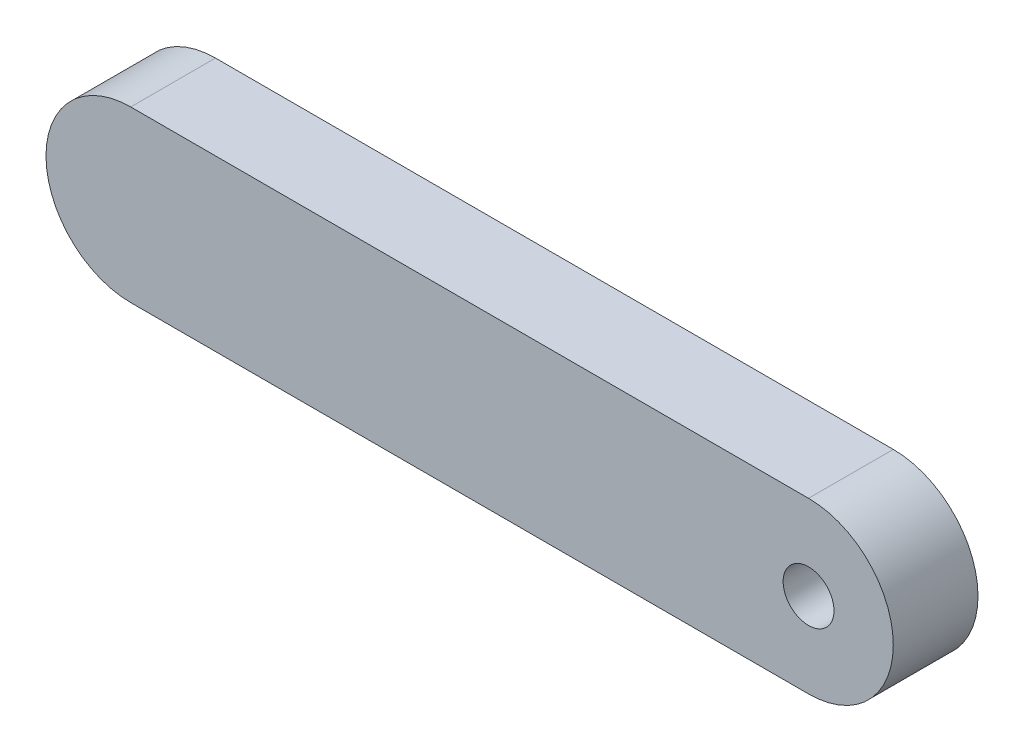
ISO-10303-21;
HEADER;
FILE_DESCRIPTION(('STEP AP214'),'2;1');
FILE_NAME('part.step','',(''),(''),'','','');
FILE_SCHEMA(('AUTOMOTIVE_DESIGN { 1 0 10303 214 1 1 1 1 }'));
ENDSEC;
DATA;
#1=APPLICATION_CONTEXT('core data for automotive mechanical design processes');
#2=APPLICATION_PROTOCOL_DEFINITION('international standard','automotive_design',2000,#1);
#3=PRODUCT_CONTEXT('',#1,'mechanical');
#4=PRODUCT('Part','Part','',(#3));
#5=PRODUCT_RELATED_PRODUCT_CATEGORY('part','',(#4));
#6=PRODUCT_DEFINITION_FORMATION('','',#4);
#7=PRODUCT_DEFINITION_CONTEXT('part definition',#1,'design');
#8=PRODUCT_DEFINITION('design','',#6,#7);
#9=PRODUCT_DEFINITION_SHAPE('','',#8);
#10=(LENGTH_UNIT() NAMED_UNIT(*) SI_UNIT(.MILLI.,.METRE.));
#11=(NAMED_UNIT(*) PLANE_ANGLE_UNIT() SI_UNIT($,.RADIAN.));
#12=(NAMED_UNIT(*) SI_UNIT($,.STERADIAN.) SOLID_ANGLE_UNIT());
#13=UNCERTAINTY_MEASURE_WITH_UNIT(LENGTH_MEASURE(1.E-05),#10,'distance_accuracy_value','');
#14=(GEOMETRIC_REPRESENTATION_CONTEXT(3) GLOBAL_UNCERTAINTY_ASSIGNED_CONTEXT((#13)) GLOBAL_UNIT_ASSIGNED_CONTEXT((#10,
#11,#12)) REPRESENTATION_CONTEXT('',''));
#15=CARTESIAN_POINT('',(0.,0.,0.));
#16=DIRECTION('',(0.,0.,1.));
#17=DIRECTION('',(1.,0.,0.));
#18=AXIS2_PLACEMENT_3D('',#15,#16,#17);
#19=CARTESIAN_POINT('',(-20.,0.,5.));
#20=DIRECTION('',(0.,0.,1.));
#21=DIRECTION('',(1.,0.,0.));
#22=AXIS2_PLACEMENT_3D('',#19,#20,#21);
#23=PLANE('',#22);
#24=CARTESIAN_POINT('',(-20.,0.,5.));
#25=DIRECTION('',(0.,0.,1.));
#26=DIRECTION('',(1.,0.,0.));
#27=AXIS2_PLACEMENT_3D('',#24,#25,#26);
#28=CIRCLE('',#27,5.00000000000001);
#29=CARTESIAN_POINT('',(-20.,5.00000000000001,5.));
#30=VERTEX_POINT('',#29);
#31=CARTESIAN_POINT('',(-20.,-5.00000000000001,5.));
#32=VERTEX_POINT('',#31);
#33=EDGE_CURVE('E85',#30,#32,#28,.T.);
#34=ORIENTED_EDGE('',*,*,#33,.T.);
#35=DIRECTION('',(1.,0.,0.));
#36=VECTOR('',#35,1.);
#37=CARTESIAN_POINT('',(-20.,-5.00000000000001,5.));
#38=LINE('',#37,#36);
#39=CARTESIAN_POINT('',(20.,-5.,5.));
#40=VERTEX_POINT('',#39);
#41=EDGE_CURVE('E80',#32,#40,#38,.T.);
#42=ORIENTED_EDGE('',*,*,#41,.T.);
#43=CARTESIAN_POINT('',(20.,0.,5.));
#44=DIRECTION('',(0.,0.,1.));
#45=DIRECTION('',(1.,0.,0.));
#46=AXIS2_PLACEMENT_3D('',#43,#44,#45);
#47=CIRCLE('',#46,5.00000000000001);
#48=CARTESIAN_POINT('',(20.,5.00000000000001,5.));
#49=VERTEX_POINT('',#48);
#50=EDGE_CURVE('E83',#40,#49,#47,.T.);
#51=ORIENTED_EDGE('',*,*,#50,.T.);
#52=DIRECTION('',(-1.,0.,0.));
#53=VECTOR('',#52,1.);
#54=CARTESIAN_POINT('',(-20.,5.00000000000001,5.));
#55=LINE('',#54,#53);
#56=EDGE_CURVE('E50',#49,#30,#55,.T.);
#57=ORIENTED_EDGE('',*,*,#56,.T.);
#58=EDGE_LOOP('',(#34,#42,#51,#57));
#59=FACE_BOUND('',#58,.T.);
#60=CARTESIAN_POINT('',(20.,0.,5.));
#61=DIRECTION('',(0.,0.,1.));
#62=DIRECTION('',(1.,0.,0.));
#63=AXIS2_PLACEMENT_3D('',#60,#61,#62);
#64=CIRCLE('',#63,1.5);
#65=CARTESIAN_POINT('',(21.5,0.,5.));
#66=VERTEX_POINT('',#65);
#67=EDGE_CURVE('E100',#66,#66,#64,.T.);
#68=ORIENTED_EDGE('',*,*,#67,.F.);
#69=EDGE_LOOP('',(#68));
#70=FACE_BOUND('',#69,.T.);
#71=ADVANCED_FACE('F33',(#59,#70),#23,.T.);
#72=CARTESIAN_POINT('',(-20.,0.,0.));
#73=DIRECTION('',(0.,0.,1.));
#74=DIRECTION('',(1.,0.,0.));
#75=AXIS2_PLACEMENT_3D('',#72,#73,#74);
#76=PLANE('',#75);
#77=CARTESIAN_POINT('',(-20.,0.,0.));
#78=DIRECTION('',(0.,0.,1.));
#79=DIRECTION('',(1.,0.,0.));
#80=AXIS2_PLACEMENT_3D('',#77,#78,#79);
#81=CIRCLE('',#80,5.00000000000001);
#82=CARTESIAN_POINT('',(-20.,5.00000000000001,0.));
#83=VERTEX_POINT('',#82);
#84=CARTESIAN_POINT('',(-20.,-5.00000000000001,0.));
#85=VERTEX_POINT('',#84);
#86=EDGE_CURVE('E97',#83,#85,#81,.T.);
#87=ORIENTED_EDGE('',*,*,#86,.F.);
#88=DIRECTION('',(-1.,0.,0.));
#89=VECTOR('',#88,1.);
#90=CARTESIAN_POINT('',(-20.,5.00000000000001,0.));
#91=LINE('',#90,#89);
#92=CARTESIAN_POINT('',(20.,5.00000000000001,0.));
#93=VERTEX_POINT('',#92);
#94=EDGE_CURVE('E73',#93,#83,#91,.T.);
#95=ORIENTED_EDGE('',*,*,#94,.F.);
#96=CARTESIAN_POINT('',(20.,0.,0.));
#97=DIRECTION('',(0.,0.,1.));
#98=DIRECTION('',(1.,0.,0.));
#99=AXIS2_PLACEMENT_3D('',#96,#97,#98);
#100=CIRCLE('',#99,5.00000000000001);
#101=CARTESIAN_POINT('',(20.,-5.,0.));
#102=VERTEX_POINT('',#101);
#103=EDGE_CURVE('E67',#102,#93,#100,.T.);
#104=ORIENTED_EDGE('',*,*,#103,.F.);
#105=DIRECTION('',(1.,0.,0.));
#106=VECTOR('',#105,1.);
#107=CARTESIAN_POINT('',(-20.,-5.00000000000001,0.));
#108=LINE('',#107,#106);
#109=EDGE_CURVE('E89',#85,#102,#108,.T.);
#110=ORIENTED_EDGE('',*,*,#109,.F.);
#111=EDGE_LOOP('',(#87,#95,#104,#110));
#112=FACE_BOUND('',#111,.T.);
#113=CARTESIAN_POINT('',(20.,0.,0.));
#114=DIRECTION('',(0.,0.,1.));
#115=DIRECTION('',(1.,0.,0.));
#116=AXIS2_PLACEMENT_3D('',#113,#114,#115);
#117=CIRCLE('',#116,1.5);
#118=CARTESIAN_POINT('',(21.5,0.,0.));
#119=VERTEX_POINT('',#118);
#120=EDGE_CURVE('E112',#119,#119,#117,.T.);
#121=ORIENTED_EDGE('',*,*,#120,.T.);
#122=EDGE_LOOP('',(#121));
#123=FACE_BOUND('',#122,.T.);
#124=ADVANCED_FACE('F108',(#112,#123),#76,.F.);
#125=CARTESIAN_POINT('',(-20.,0.,5.));
#126=DIRECTION('',(0.,0.,-1.));
#127=DIRECTION('',(-1.,0.,0.));
#128=AXIS2_PLACEMENT_3D('',#125,#126,#127);
#129=CYLINDRICAL_SURFACE('',#128,5.00000000000001);
#130=ORIENTED_EDGE('',*,*,#86,.T.);
#131=DIRECTION('',(0.,0.,-1.));
#132=VECTOR('',#131,1.);
#133=CARTESIAN_POINT('',(-20.,-5.00000000000001,5.));
#134=LINE('',#133,#132);
#135=EDGE_CURVE('E11',#32,#85,#134,.T.);
#136=ORIENTED_EDGE('',*,*,#135,.F.);
#137=ORIENTED_EDGE('',*,*,#33,.F.);
#138=DIRECTION('',(0.,0.,-1.));
#139=VECTOR('',#138,1.);
#140=CARTESIAN_POINT('',(-20.,5.00000000000001,5.));
#141=LINE('',#140,#139);
#142=EDGE_CURVE('E93',#30,#83,#141,.T.);
#143=ORIENTED_EDGE('',*,*,#142,.T.);
#144=EDGE_LOOP('',(#130,#136,#137,#143));
#145=FACE_BOUND('',#144,.T.);
#146=ADVANCED_FACE('F35',(#145),#129,.T.);
#147=CARTESIAN_POINT('',(-20.,-5.00000000000001,5.));
#148=DIRECTION('',(0.,1.,0.));
#149=DIRECTION('',(-1.,0.,0.));
#150=AXIS2_PLACEMENT_3D('',#147,#148,#149);
#151=PLANE('',#150);
#152=ORIENTED_EDGE('',*,*,#109,.T.);
#153=DIRECTION('',(0.,0.,-1.));
#154=VECTOR('',#153,1.);
#155=CARTESIAN_POINT('',(20.,-5.,5.));
#156=LINE('',#155,#154);
#157=EDGE_CURVE('E42',#40,#102,#156,.T.);
#158=ORIENTED_EDGE('',*,*,#157,.F.);
#159=ORIENTED_EDGE('',*,*,#41,.F.);
#160=ORIENTED_EDGE('',*,*,#135,.T.);
#161=EDGE_LOOP('',(#152,#158,#159,#160));
#162=FACE_BOUND('',#161,.T.);
#163=ADVANCED_FACE('F88',(#162),#151,.F.);
#164=CARTESIAN_POINT('',(20.,0.,5.));
#165=DIRECTION('',(0.,0.,-1.));
#166=DIRECTION('',(-1.,0.,0.));
#167=AXIS2_PLACEMENT_3D('',#164,#165,#166);
#168=CYLINDRICAL_SURFACE('',#167,5.00000000000001);
#169=ORIENTED_EDGE('',*,*,#103,.T.);
#170=DIRECTION('',(0.,0.,-1.));
#171=VECTOR('',#170,1.);
#172=CARTESIAN_POINT('',(20.,5.00000000000001,5.));
#173=LINE('',#172,#171);
#174=EDGE_CURVE('E90',#49,#93,#173,.T.);
#175=ORIENTED_EDGE('',*,*,#174,.F.);
#176=ORIENTED_EDGE('',*,*,#50,.F.);
#177=ORIENTED_EDGE('',*,*,#157,.T.);
#178=EDGE_LOOP('',(#169,#175,#176,#177));
#179=FACE_BOUND('',#178,.T.);
#180=ADVANCED_FACE('F91',(#179),#168,.T.);
#181=CARTESIAN_POINT('',(-20.,5.00000000000001,5.));
#182=DIRECTION('',(0.,-1.,0.));
#183=DIRECTION('',(1.,0.,0.));
#184=AXIS2_PLACEMENT_3D('',#181,#182,#183);
#185=PLANE('',#184);
#186=ORIENTED_EDGE('',*,*,#94,.T.);
#187=ORIENTED_EDGE('',*,*,#142,.F.);
#188=ORIENTED_EDGE('',*,*,#56,.F.);
#189=ORIENTED_EDGE('',*,*,#174,.T.);
#190=EDGE_LOOP('',(#186,#187,#188,#189));
#191=FACE_BOUND('',#190,.T.);
#192=ADVANCED_FACE('F105',(#191),#185,.F.);
#193=CARTESIAN_POINT('',(20.,0.,5.));
#194=DIRECTION('',(0.,0.,-1.));
#195=DIRECTION('',(-1.,0.,0.));
#196=AXIS2_PLACEMENT_3D('',#193,#194,#195);
#197=CYLINDRICAL_SURFACE('',#196,1.5);
#198=ORIENTED_EDGE('',*,*,#67,.T.);
#199=EDGE_LOOP('',(#198));
#200=FACE_BOUND('',#199,.T.);
#201=ORIENTED_EDGE('',*,*,#120,.F.);
#202=EDGE_LOOP('',(#201));
#203=FACE_BOUND('',#202,.T.);
#204=ADVANCED_FACE('F118',(#200,#203),#197,.F.);
#205=CLOSED_SHELL('',(#71,#124,#146,#163,#180,#192,#204));
#206=MANIFOLD_SOLID_BREP('B2',#205);
#207=ADVANCED_BREP_SHAPE_REPRESENTATION('',(#18,#206),#14);
#208=SHAPE_DEFINITION_REPRESENTATION(#9,#207);
ENDSEC;
END-ISO-10303-21;
